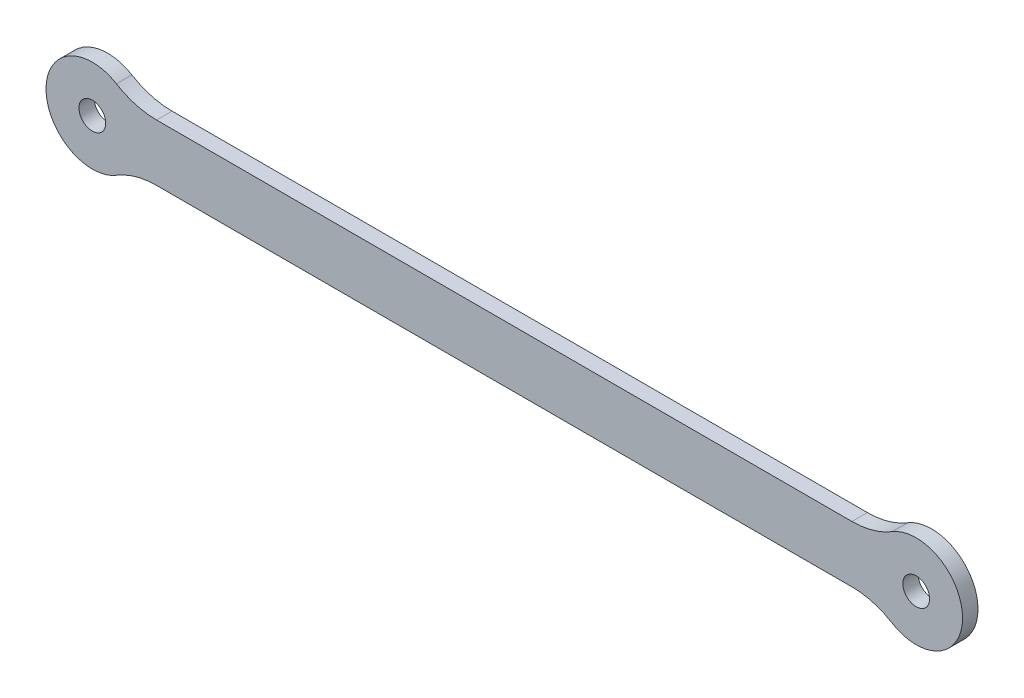
ISO-10303-21;
HEADER;
FILE_DESCRIPTION(('STEP AP214'),'2;1');
FILE_NAME('part.step','',(''),(''),'','','');
FILE_SCHEMA(('AUTOMOTIVE_DESIGN { 1 0 10303 214 1 1 1 1 }'));
ENDSEC;
DATA;
#1=APPLICATION_CONTEXT('core data for automotive mechanical design processes');
#2=APPLICATION_PROTOCOL_DEFINITION('international standard','automotive_design',2000,#1);
#3=PRODUCT_CONTEXT('',#1,'mechanical');
#4=PRODUCT('Part','Part','',(#3));
#5=PRODUCT_RELATED_PRODUCT_CATEGORY('part','',(#4));
#6=PRODUCT_DEFINITION_FORMATION('','',#4);
#7=PRODUCT_DEFINITION_CONTEXT('part definition',#1,'design');
#8=PRODUCT_DEFINITION('design','',#6,#7);
#9=PRODUCT_DEFINITION_SHAPE('','',#8);
#10=(LENGTH_UNIT() NAMED_UNIT(*) SI_UNIT(.MILLI.,.METRE.));
#11=(NAMED_UNIT(*) PLANE_ANGLE_UNIT() SI_UNIT($,.RADIAN.));
#12=(NAMED_UNIT(*) SI_UNIT($,.STERADIAN.) SOLID_ANGLE_UNIT());
#13=UNCERTAINTY_MEASURE_WITH_UNIT(LENGTH_MEASURE(1.E-05),#10,'distance_accuracy_value','');
#14=(GEOMETRIC_REPRESENTATION_CONTEXT(3) GLOBAL_UNCERTAINTY_ASSIGNED_CONTEXT((#13)) GLOBAL_UNIT_ASSIGNED_CONTEXT((#10,
#11,#12)) REPRESENTATION_CONTEXT('',''));
#15=CARTESIAN_POINT('',(0.,0.,0.));
#16=DIRECTION('',(0.,0.,1.));
#17=DIRECTION('',(1.,0.,0.));
#18=AXIS2_PLACEMENT_3D('',#15,#16,#17);
#19=CARTESIAN_POINT('',(-147.520016025651,-20.5,5.));
#20=DIRECTION('',(0.,0.,-1.));
#21=DIRECTION('',(-1.,0.,0.));
#22=AXIS2_PLACEMENT_3D('',#19,#20,#21);
#23=CYLINDRICAL_SURFACE('',#22,15.);
#24=DIRECTION('',(0.,0.,1.));
#25=VECTOR('',#24,1.);
#26=CARTESIAN_POINT('',(-147.520016025651,-5.50000000000002,5.));
#27=LINE('',#26,#25);
#28=CARTESIAN_POINT('',(-147.520016025651,-5.50000000000002,0.));
#29=VERTEX_POINT('',#28);
#30=CARTESIAN_POINT('',(-147.520016025651,-5.50000000000002,3.));
#31=VERTEX_POINT('',#30);
#32=EDGE_CURVE('E111',#29,#31,#27,.T.);
#33=ORIENTED_EDGE('',*,*,#32,.T.);
#34=CARTESIAN_POINT('',(-147.520016025651,-20.5,3.));
#35=DIRECTION('',(0.,0.,-1.));
#36=DIRECTION('',(-1.,0.,0.));
#37=AXIS2_PLACEMENT_3D('',#34,#35,#36);
#38=CIRCLE('',#37,15.);
#39=CARTESIAN_POINT('',(-155.320006009619,-7.68750000000003,3.));
#40=VERTEX_POINT('',#39);
#41=EDGE_CURVE('E89',#31,#40,#38,.F.);
#42=ORIENTED_EDGE('',*,*,#41,.T.);
#43=DIRECTION('',(0.,0.,-1.));
#44=VECTOR('',#43,1.);
#45=CARTESIAN_POINT('',(-155.320006009619,-7.68749999999999,5.));
#46=LINE('',#45,#44);
#47=CARTESIAN_POINT('',(-155.320006009619,-7.6875,0.));
#48=VERTEX_POINT('',#47);
#49=EDGE_CURVE('E84',#48,#40,#46,.F.);
#50=ORIENTED_EDGE('',*,*,#49,.F.);
#51=CARTESIAN_POINT('',(-147.520016025651,-20.5,0.));
#52=DIRECTION('',(0.,0.,-1.));
#53=DIRECTION('',(-1.,0.,0.));
#54=AXIS2_PLACEMENT_3D('',#51,#52,#53);
#55=CIRCLE('',#54,15.);
#56=EDGE_CURVE('E129',#48,#29,#55,.T.);
#57=ORIENTED_EDGE('',*,*,#56,.T.);
#58=EDGE_LOOP('',(#33,#42,#50,#57));
#59=FACE_BOUND('',#58,.T.);
#60=ADVANCED_FACE('F33',(#59),#23,.F.);
#61=CARTESIAN_POINT('',(-152.876096575612,-5.50000000000002,5.));
#62=DIRECTION('',(0.,1.,0.));
#63=DIRECTION('',(0.,0.,1.));
#64=AXIS2_PLACEMENT_3D('',#61,#62,#63);
#65=PLANE('',#64);
#66=DIRECTION('',(0.,0.,-1.));
#67=VECTOR('',#66,1.);
#68=CARTESIAN_POINT('',(-12.4799839743487,-5.50000000000002,5.));
#69=LINE('',#68,#67);
#70=CARTESIAN_POINT('',(-12.4799839743487,-5.50000000000002,0.));
#71=VERTEX_POINT('',#70);
#72=CARTESIAN_POINT('',(-12.4799839743487,-5.50000000000001,3.));
#73=VERTEX_POINT('',#72);
#74=EDGE_CURVE('E116',#71,#73,#69,.F.);
#75=ORIENTED_EDGE('',*,*,#74,.T.);
#76=DIRECTION('',(-1.,0.,0.));
#77=VECTOR('',#76,1.);
#78=CARTESIAN_POINT('',(-152.876096575612,-5.50000000000002,3.));
#79=LINE('',#78,#77);
#80=EDGE_CURVE('E112',#73,#31,#79,.T.);
#81=ORIENTED_EDGE('',*,*,#80,.T.);
#82=ORIENTED_EDGE('',*,*,#32,.F.);
#83=DIRECTION('',(1.,0.,0.));
#84=VECTOR('',#83,1.);
#85=CARTESIAN_POINT('',(-160.,-5.50000000000002,0.));
#86=LINE('',#85,#84);
#87=EDGE_CURVE('E128',#29,#71,#86,.T.);
#88=ORIENTED_EDGE('',*,*,#87,.T.);
#89=EDGE_LOOP('',(#75,#81,#82,#88));
#90=FACE_BOUND('',#89,.T.);
#91=ADVANCED_FACE('F147',(#90),#65,.F.);
#92=CARTESIAN_POINT('',(-12.4799839743487,-20.5,5.));
#93=DIRECTION('',(0.,0.,-1.));
#94=DIRECTION('',(-1.,0.,0.));
#95=AXIS2_PLACEMENT_3D('',#92,#93,#94);
#96=CYLINDRICAL_SURFACE('',#95,15.);
#97=DIRECTION('',(0.,0.,-1.));
#98=VECTOR('',#97,1.);
#99=CARTESIAN_POINT('',(-4.67999399038075,-7.68750000000001,5.));
#100=LINE('',#99,#98);
#101=CARTESIAN_POINT('',(-4.67999399038075,-7.68750000000001,3.));
#102=VERTEX_POINT('',#101);
#103=CARTESIAN_POINT('',(-4.67999399038075,-7.68750000000001,0.));
#104=VERTEX_POINT('',#103);
#105=EDGE_CURVE('E144',#102,#104,#100,.T.);
#106=ORIENTED_EDGE('',*,*,#105,.F.);
#107=CARTESIAN_POINT('',(-12.4799839743487,-20.5,3.));
#108=DIRECTION('',(0.,0.,-1.));
#109=DIRECTION('',(-1.,0.,0.));
#110=AXIS2_PLACEMENT_3D('',#107,#108,#109);
#111=CIRCLE('',#110,15.);
#112=EDGE_CURVE('E154',#102,#73,#111,.F.);
#113=ORIENTED_EDGE('',*,*,#112,.T.);
#114=ORIENTED_EDGE('',*,*,#74,.F.);
#115=CARTESIAN_POINT('',(-12.4799839743487,-20.5,0.));
#116=DIRECTION('',(0.,0.,-1.));
#117=DIRECTION('',(-1.,0.,0.));
#118=AXIS2_PLACEMENT_3D('',#115,#116,#117);
#119=CIRCLE('',#118,15.);
#120=EDGE_CURVE('E126',#71,#104,#119,.T.);
#121=ORIENTED_EDGE('',*,*,#120,.T.);
#122=EDGE_LOOP('',(#106,#113,#114,#121));
#123=FACE_BOUND('',#122,.T.);
#124=ADVANCED_FACE('F153',(#123),#96,.F.);
#125=CARTESIAN_POINT('',(0.,0.,5.));
#126=DIRECTION('',(0.,0.,-1.));
#127=DIRECTION('',(-1.,0.,0.));
#128=AXIS2_PLACEMENT_3D('',#125,#126,#127);
#129=CYLINDRICAL_SURFACE('',#128,9.);
#130=CARTESIAN_POINT('',(0.,0.,3.));
#131=DIRECTION('',(0.,0.,-1.));
#132=DIRECTION('',(-1.,0.,0.));
#133=AXIS2_PLACEMENT_3D('',#130,#131,#132);
#134=CIRCLE('',#133,9.);
#135=CARTESIAN_POINT('',(-4.67999399038076,7.68749999999999,3.));
#136=VERTEX_POINT('',#135);
#137=EDGE_CURVE('E164',#102,#136,#134,.F.);
#138=ORIENTED_EDGE('',*,*,#137,.F.);
#139=ORIENTED_EDGE('',*,*,#105,.T.);
#140=CARTESIAN_POINT('',(0.,0.,0.));
#141=DIRECTION('',(0.,0.,-1.));
#142=DIRECTION('',(-1.,0.,0.));
#143=AXIS2_PLACEMENT_3D('',#140,#141,#142);
#144=CIRCLE('',#143,9.);
#145=CARTESIAN_POINT('',(-4.67999399038076,7.68749999999999,0.));
#146=VERTEX_POINT('',#145);
#147=EDGE_CURVE('E123',#104,#146,#144,.F.);
#148=ORIENTED_EDGE('',*,*,#147,.T.);
#149=DIRECTION('',(0.,0.,-1.));
#150=VECTOR('',#149,1.);
#151=CARTESIAN_POINT('',(-4.67999399038076,7.6875,5.));
#152=LINE('',#151,#150);
#153=EDGE_CURVE('E141',#146,#136,#152,.F.);
#154=ORIENTED_EDGE('',*,*,#153,.T.);
#155=EDGE_LOOP('',(#138,#139,#148,#154));
#156=FACE_BOUND('',#155,.T.);
#157=ADVANCED_FACE('F163',(#156),#129,.T.);
#158=CARTESIAN_POINT('',(-12.4799839743487,20.5,5.));
#159=DIRECTION('',(0.,0.,-1.));
#160=DIRECTION('',(-1.,0.,0.));
#161=AXIS2_PLACEMENT_3D('',#158,#159,#160);
#162=CYLINDRICAL_SURFACE('',#161,15.);
#163=DIRECTION('',(0.,0.,-1.));
#164=VECTOR('',#163,1.);
#165=CARTESIAN_POINT('',(-12.4799839743487,5.49999999999998,5.));
#166=LINE('',#165,#164);
#167=CARTESIAN_POINT('',(-12.4799839743487,5.49999999999998,0.));
#168=VERTEX_POINT('',#167);
#169=CARTESIAN_POINT('',(-12.4799839743487,5.49999999999998,3.));
#170=VERTEX_POINT('',#169);
#171=EDGE_CURVE('E135',#168,#170,#166,.F.);
#172=ORIENTED_EDGE('',*,*,#171,.T.);
#173=CARTESIAN_POINT('',(-12.4799839743487,20.5,3.));
#174=DIRECTION('',(0.,0.,-1.));
#175=DIRECTION('',(-1.,0.,0.));
#176=AXIS2_PLACEMENT_3D('',#173,#174,#175);
#177=CIRCLE('',#176,15.);
#178=EDGE_CURVE('E166',#170,#136,#177,.F.);
#179=ORIENTED_EDGE('',*,*,#178,.T.);
#180=ORIENTED_EDGE('',*,*,#153,.F.);
#181=CARTESIAN_POINT('',(-12.4799839743487,20.5,0.));
#182=DIRECTION('',(0.,0.,-1.));
#183=DIRECTION('',(-1.,0.,0.));
#184=AXIS2_PLACEMENT_3D('',#181,#182,#183);
#185=CIRCLE('',#184,15.);
#186=EDGE_CURVE('E120',#146,#168,#185,.T.);
#187=ORIENTED_EDGE('',*,*,#186,.T.);
#188=EDGE_LOOP('',(#172,#179,#180,#187));
#189=FACE_BOUND('',#188,.T.);
#190=ADVANCED_FACE('F179',(#189),#162,.F.);
#191=CARTESIAN_POINT('',(-152.876096575612,5.49999999999998,5.));
#192=DIRECTION('',(0.,-1.,0.));
#193=DIRECTION('',(0.,0.,-1.));
#194=AXIS2_PLACEMENT_3D('',#191,#192,#193);
#195=PLANE('',#194);
#196=DIRECTION('',(0.,0.,-1.));
#197=VECTOR('',#196,1.);
#198=CARTESIAN_POINT('',(-147.520016025651,5.49999999999999,5.));
#199=LINE('',#198,#197);
#200=CARTESIAN_POINT('',(-147.520016025651,5.49999999999999,0.));
#201=VERTEX_POINT('',#200);
#202=CARTESIAN_POINT('',(-147.520016025651,5.49999999999999,3.));
#203=VERTEX_POINT('',#202);
#204=EDGE_CURVE('E132',#201,#203,#199,.F.);
#205=ORIENTED_EDGE('',*,*,#204,.T.);
#206=DIRECTION('',(1.,0.,0.));
#207=VECTOR('',#206,1.);
#208=CARTESIAN_POINT('',(-152.876096575612,5.49999999999998,3.));
#209=LINE('',#208,#207);
#210=EDGE_CURVE('E169',#203,#170,#209,.T.);
#211=ORIENTED_EDGE('',*,*,#210,.T.);
#212=ORIENTED_EDGE('',*,*,#171,.F.);
#213=DIRECTION('',(1.,0.,0.));
#214=VECTOR('',#213,1.);
#215=CARTESIAN_POINT('',(-160.,5.49999999999998,0.));
#216=LINE('',#215,#214);
#217=EDGE_CURVE('E41',#168,#201,#216,.F.);
#218=ORIENTED_EDGE('',*,*,#217,.T.);
#219=EDGE_LOOP('',(#205,#211,#212,#218));
#220=FACE_BOUND('',#219,.T.);
#221=ADVANCED_FACE('F175',(#220),#195,.F.);
#222=CARTESIAN_POINT('',(-147.520016025651,20.5,5.));
#223=DIRECTION('',(0.,0.,-1.));
#224=DIRECTION('',(-1.,0.,0.));
#225=AXIS2_PLACEMENT_3D('',#222,#223,#224);
#226=CYLINDRICAL_SURFACE('',#225,15.);
#227=DIRECTION('',(0.,0.,-1.));
#228=VECTOR('',#227,1.);
#229=CARTESIAN_POINT('',(-155.320006009619,7.68749999999998,5.));
#230=LINE('',#229,#228);
#231=CARTESIAN_POINT('',(-155.320006009619,7.68749999999998,3.));
#232=VERTEX_POINT('',#231);
#233=CARTESIAN_POINT('',(-155.320006009619,7.68749999999999,0.));
#234=VERTEX_POINT('',#233);
#235=EDGE_CURVE('E57',#232,#234,#230,.T.);
#236=ORIENTED_EDGE('',*,*,#235,.F.);
#237=CARTESIAN_POINT('',(-147.520016025651,20.5,3.));
#238=DIRECTION('',(0.,0.,-1.));
#239=DIRECTION('',(-1.,0.,0.));
#240=AXIS2_PLACEMENT_3D('',#237,#238,#239);
#241=CIRCLE('',#240,15.);
#242=EDGE_CURVE('E49',#232,#203,#241,.F.);
#243=ORIENTED_EDGE('',*,*,#242,.T.);
#244=ORIENTED_EDGE('',*,*,#204,.F.);
#245=CARTESIAN_POINT('',(-147.520016025651,20.5,0.));
#246=DIRECTION('',(0.,0.,-1.));
#247=DIRECTION('',(-1.,0.,0.));
#248=AXIS2_PLACEMENT_3D('',#245,#246,#247);
#249=CIRCLE('',#248,15.);
#250=EDGE_CURVE('E11',#201,#234,#249,.T.);
#251=ORIENTED_EDGE('',*,*,#250,.T.);
#252=EDGE_LOOP('',(#236,#243,#244,#251));
#253=FACE_BOUND('',#252,.T.);
#254=ADVANCED_FACE('F226',(#253),#226,.F.);
#255=CARTESIAN_POINT('',(-160.,0.,5.));
#256=DIRECTION('',(0.,0.,-1.));
#257=DIRECTION('',(-1.,0.,0.));
#258=AXIS2_PLACEMENT_3D('',#255,#256,#257);
#259=CYLINDRICAL_SURFACE('',#258,9.00000000000001);
#260=CARTESIAN_POINT('',(-160.,0.,3.));
#261=DIRECTION('',(0.,0.,-1.));
#262=DIRECTION('',(-1.,0.,0.));
#263=AXIS2_PLACEMENT_3D('',#260,#261,#262);
#264=CIRCLE('',#263,9.00000000000001);
#265=EDGE_CURVE('E105',#232,#40,#264,.F.);
#266=ORIENTED_EDGE('',*,*,#265,.F.);
#267=ORIENTED_EDGE('',*,*,#235,.T.);
#268=CARTESIAN_POINT('',(-160.,0.,0.));
#269=DIRECTION('',(0.,0.,-1.));
#270=DIRECTION('',(-1.,0.,0.));
#271=AXIS2_PLACEMENT_3D('',#268,#269,#270);
#272=CIRCLE('',#271,9.00000000000001);
#273=EDGE_CURVE('E36',#234,#48,#272,.F.);
#274=ORIENTED_EDGE('',*,*,#273,.T.);
#275=ORIENTED_EDGE('',*,*,#49,.T.);
#276=EDGE_LOOP('',(#266,#267,#274,#275));
#277=FACE_BOUND('',#276,.T.);
#278=ADVANCED_FACE('F114',(#277),#259,.T.);
#279=CARTESIAN_POINT('',(-160.,0.,0.));
#280=DIRECTION('',(0.,0.,1.));
#281=DIRECTION('',(1.,0.,0.));
#282=AXIS2_PLACEMENT_3D('',#279,#280,#281);
#283=PLANE('',#282);
#284=ORIENTED_EDGE('',*,*,#186,.F.);
#285=ORIENTED_EDGE('',*,*,#147,.F.);
#286=ORIENTED_EDGE('',*,*,#120,.F.);
#287=ORIENTED_EDGE('',*,*,#87,.F.);
#288=ORIENTED_EDGE('',*,*,#56,.F.);
#289=ORIENTED_EDGE('',*,*,#273,.F.);
#290=ORIENTED_EDGE('',*,*,#250,.F.);
#291=ORIENTED_EDGE('',*,*,#217,.F.);
#292=EDGE_LOOP('',(#284,#285,#286,#287,#288,#289,#290,#291));
#293=FACE_BOUND('',#292,.T.);
#294=CARTESIAN_POINT('',(-160.,0.,0.));
#295=DIRECTION('',(0.,0.,1.));
#296=DIRECTION('',(1.,0.,0.));
#297=AXIS2_PLACEMENT_3D('',#294,#295,#296);
#298=CIRCLE('',#297,2.59999999999999);
#299=CARTESIAN_POINT('',(-157.4,0.,0.));
#300=VERTEX_POINT('',#299);
#301=EDGE_CURVE('E108',#300,#300,#298,.T.);
#302=ORIENTED_EDGE('',*,*,#301,.T.);
#303=EDGE_LOOP('',(#302));
#304=FACE_BOUND('',#303,.T.);
#305=CARTESIAN_POINT('',(0.,0.,0.));
#306=DIRECTION('',(0.,0.,1.));
#307=DIRECTION('',(1.,0.,0.));
#308=AXIS2_PLACEMENT_3D('',#305,#306,#307);
#309=CIRCLE('',#308,2.6);
#310=CARTESIAN_POINT('',(2.6,0.,0.));
#311=VERTEX_POINT('',#310);
#312=EDGE_CURVE('E185',#311,#311,#309,.T.);
#313=ORIENTED_EDGE('',*,*,#312,.T.);
#314=EDGE_LOOP('',(#313));
#315=FACE_BOUND('',#314,.T.);
#316=ADVANCED_FACE('F158',(#293,#304,#315),#283,.F.);
#317=CARTESIAN_POINT('',(0.,0.,3.));
#318=DIRECTION('',(0.,0.,-1.));
#319=DIRECTION('',(-1.,0.,0.));
#320=AXIS2_PLACEMENT_3D('',#317,#318,#319);
#321=PLANE('',#320);
#322=ORIENTED_EDGE('',*,*,#112,.F.);
#323=ORIENTED_EDGE('',*,*,#137,.T.);
#324=ORIENTED_EDGE('',*,*,#178,.F.);
#325=ORIENTED_EDGE('',*,*,#210,.F.);
#326=ORIENTED_EDGE('',*,*,#242,.F.);
#327=ORIENTED_EDGE('',*,*,#265,.T.);
#328=ORIENTED_EDGE('',*,*,#41,.F.);
#329=ORIENTED_EDGE('',*,*,#80,.F.);
#330=EDGE_LOOP('',(#322,#323,#324,#325,#326,#327,#328,#329));
#331=FACE_BOUND('',#330,.T.);
#332=CARTESIAN_POINT('',(-160.,0.,3.));
#333=DIRECTION('',(0.,0.,1.));
#334=DIRECTION('',(1.,0.,0.));
#335=AXIS2_PLACEMENT_3D('',#332,#333,#334);
#336=CIRCLE('',#335,2.59999999999999);
#337=CARTESIAN_POINT('',(-157.4,0.,3.));
#338=VERTEX_POINT('',#337);
#339=EDGE_CURVE('E182',#338,#338,#336,.T.);
#340=ORIENTED_EDGE('',*,*,#339,.F.);
#341=EDGE_LOOP('',(#340));
#342=FACE_BOUND('',#341,.T.);
#343=CARTESIAN_POINT('',(0.,0.,3.));
#344=DIRECTION('',(0.,0.,1.));
#345=DIRECTION('',(1.,0.,0.));
#346=AXIS2_PLACEMENT_3D('',#343,#344,#345);
#347=CIRCLE('',#346,2.6);
#348=CARTESIAN_POINT('',(2.6,0.,3.));
#349=VERTEX_POINT('',#348);
#350=EDGE_CURVE('E188',#349,#349,#347,.T.);
#351=ORIENTED_EDGE('',*,*,#350,.F.);
#352=EDGE_LOOP('',(#351));
#353=FACE_BOUND('',#352,.T.);
#354=ADVANCED_FACE('F106',(#331,#342,#353),#321,.F.);
#355=CARTESIAN_POINT('',(-160.,0.,0.));
#356=DIRECTION('',(0.,0.,1.));
#357=DIRECTION('',(1.,0.,0.));
#358=AXIS2_PLACEMENT_3D('',#355,#356,#357);
#359=CYLINDRICAL_SURFACE('',#358,2.59999999999999);
#360=ORIENTED_EDGE('',*,*,#301,.F.);
#361=EDGE_LOOP('',(#360));
#362=FACE_BOUND('',#361,.T.);
#363=ORIENTED_EDGE('',*,*,#339,.T.);
#364=EDGE_LOOP('',(#363));
#365=FACE_BOUND('',#364,.T.);
#366=ADVANCED_FACE('F198',(#362,#365),#359,.F.);
#367=CARTESIAN_POINT('',(0.,0.,0.));
#368=DIRECTION('',(0.,0.,1.));
#369=DIRECTION('',(1.,0.,0.));
#370=AXIS2_PLACEMENT_3D('',#367,#368,#369);
#371=CYLINDRICAL_SURFACE('',#370,2.6);
#372=ORIENTED_EDGE('',*,*,#312,.F.);
#373=EDGE_LOOP('',(#372));
#374=FACE_BOUND('',#373,.T.);
#375=ORIENTED_EDGE('',*,*,#350,.T.);
#376=EDGE_LOOP('',(#375));
#377=FACE_BOUND('',#376,.T.);
#378=ADVANCED_FACE('F195',(#374,#377),#371,.F.);
#379=CLOSED_SHELL('',(#60,#91,#124,#157,#190,#221,#254,#278,#316,#354,#366,#378));
#380=MANIFOLD_SOLID_BREP('B2',#379);
#381=ADVANCED_BREP_SHAPE_REPRESENTATION('',(#18,#380),#14);
#382=SHAPE_DEFINITION_REPRESENTATION(#9,#381);
ENDSEC;
END-ISO-10303-21;
